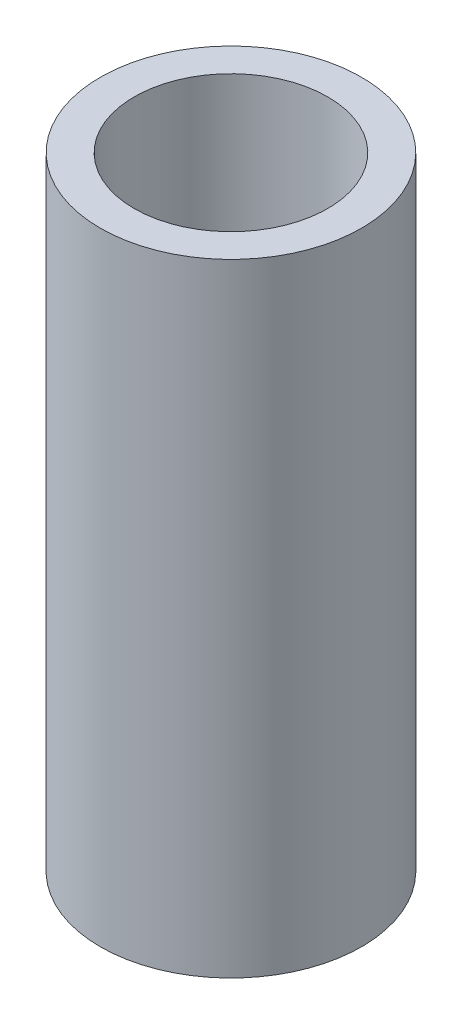
ISO-10303-21;
HEADER;
FILE_DESCRIPTION(('STEP AP214'),'2;1');
FILE_NAME('part.step','',(''),(''),'','','');
FILE_SCHEMA(('AUTOMOTIVE_DESIGN { 1 0 10303 214 1 1 1 1 }'));
ENDSEC;
DATA;
#1=APPLICATION_CONTEXT('core data for automotive mechanical design processes');
#2=APPLICATION_PROTOCOL_DEFINITION('international standard','automotive_design',2000,#1);
#3=PRODUCT_CONTEXT('',#1,'mechanical');
#4=PRODUCT('Part','Part','',(#3));
#5=PRODUCT_RELATED_PRODUCT_CATEGORY('part','',(#4));
#6=PRODUCT_DEFINITION_FORMATION('','',#4);
#7=PRODUCT_DEFINITION_CONTEXT('part definition',#1,'design');
#8=PRODUCT_DEFINITION('design','',#6,#7);
#9=PRODUCT_DEFINITION_SHAPE('','',#8);
#10=(LENGTH_UNIT() NAMED_UNIT(*) SI_UNIT(.MILLI.,.METRE.));
#11=(NAMED_UNIT(*) PLANE_ANGLE_UNIT() SI_UNIT($,.RADIAN.));
#12=(NAMED_UNIT(*) SI_UNIT($,.STERADIAN.) SOLID_ANGLE_UNIT());
#13=UNCERTAINTY_MEASURE_WITH_UNIT(LENGTH_MEASURE(1.E-05),#10,'distance_accuracy_value','');
#14=(GEOMETRIC_REPRESENTATION_CONTEXT(3) GLOBAL_UNCERTAINTY_ASSIGNED_CONTEXT((#13)) GLOBAL_UNIT_ASSIGNED_CONTEXT((#10,
#11,#12)) REPRESENTATION_CONTEXT('',''));
#15=CARTESIAN_POINT('',(0.,0.,0.));
#16=DIRECTION('',(0.,0.,1.));
#17=DIRECTION('',(1.,0.,0.));
#18=AXIS2_PLACEMENT_3D('',#15,#16,#17);
#19=CARTESIAN_POINT('',(0.,50.8,0.));
#20=DIRECTION('',(0.,1.,0.));
#21=DIRECTION('',(0.,0.,1.));
#22=AXIS2_PLACEMENT_3D('',#19,#20,#21);
#23=PLANE('',#22);
#24=CARTESIAN_POINT('',(0.,50.8,0.));
#25=DIRECTION('',(0.,1.,0.));
#26=DIRECTION('',(0.,0.,1.));
#27=AXIS2_PLACEMENT_3D('',#24,#25,#26);
#28=CIRCLE('',#27,10.668);
#29=CARTESIAN_POINT('',(0.,50.8,10.668));
#30=VERTEX_POINT('',#29);
#31=EDGE_CURVE('E10',#30,#30,#28,.T.);
#32=ORIENTED_EDGE('',*,*,#31,.T.);
#33=EDGE_LOOP('',(#32));
#34=FACE_BOUND('',#33,.T.);
#35=CARTESIAN_POINT('',(0.,50.8,0.));
#36=DIRECTION('',(0.,1.,0.));
#37=DIRECTION('',(0.,0.,1.));
#38=AXIS2_PLACEMENT_3D('',#35,#36,#37);
#39=CIRCLE('',#38,7.8994);
#40=CARTESIAN_POINT('',(0.,50.8,7.8994));
#41=VERTEX_POINT('',#40);
#42=EDGE_CURVE('E44',#41,#41,#39,.T.);
#43=ORIENTED_EDGE('',*,*,#42,.F.);
#44=EDGE_LOOP('',(#43));
#45=FACE_BOUND('',#44,.T.);
#46=ADVANCED_FACE('F33',(#34,#45),#23,.T.);
#47=CARTESIAN_POINT('',(0.,0.,0.));
#48=DIRECTION('',(0.,1.,0.));
#49=DIRECTION('',(0.,0.,1.));
#50=AXIS2_PLACEMENT_3D('',#47,#48,#49);
#51=PLANE('',#50);
#52=CARTESIAN_POINT('',(0.,0.,0.));
#53=DIRECTION('',(0.,1.,0.));
#54=DIRECTION('',(0.,0.,1.));
#55=AXIS2_PLACEMENT_3D('',#52,#53,#54);
#56=CIRCLE('',#55,10.668);
#57=CARTESIAN_POINT('',(0.,0.,10.668));
#58=VERTEX_POINT('',#57);
#59=EDGE_CURVE('E37',#58,#58,#56,.T.);
#60=ORIENTED_EDGE('',*,*,#59,.F.);
#61=EDGE_LOOP('',(#60));
#62=FACE_BOUND('',#61,.T.);
#63=CARTESIAN_POINT('',(0.,0.,0.));
#64=DIRECTION('',(0.,1.,0.));
#65=DIRECTION('',(0.,0.,1.));
#66=AXIS2_PLACEMENT_3D('',#63,#64,#65);
#67=CIRCLE('',#66,7.8994);
#68=CARTESIAN_POINT('',(0.,0.,7.8994));
#69=VERTEX_POINT('',#68);
#70=EDGE_CURVE('E46',#69,#69,#67,.T.);
#71=ORIENTED_EDGE('',*,*,#70,.T.);
#72=EDGE_LOOP('',(#71));
#73=FACE_BOUND('',#72,.T.);
#74=ADVANCED_FACE('F56',(#62,#73),#51,.F.);
#75=CARTESIAN_POINT('',(0.,50.8,0.));
#76=DIRECTION('',(0.,-1.,0.));
#77=DIRECTION('',(0.,0.,-1.));
#78=AXIS2_PLACEMENT_3D('',#75,#76,#77);
#79=CYLINDRICAL_SURFACE('',#78,10.668);
#80=ORIENTED_EDGE('',*,*,#31,.F.);
#81=EDGE_LOOP('',(#80));
#82=FACE_BOUND('',#81,.T.);
#83=ORIENTED_EDGE('',*,*,#59,.T.);
#84=EDGE_LOOP('',(#83));
#85=FACE_BOUND('',#84,.T.);
#86=ADVANCED_FACE('F35',(#82,#85),#79,.T.);
#87=CARTESIAN_POINT('',(0.,50.8,0.));
#88=DIRECTION('',(0.,-1.,0.));
#89=DIRECTION('',(0.,0.,-1.));
#90=AXIS2_PLACEMENT_3D('',#87,#88,#89);
#91=CYLINDRICAL_SURFACE('',#90,7.8994);
#92=ORIENTED_EDGE('',*,*,#42,.T.);
#93=EDGE_LOOP('',(#92));
#94=FACE_BOUND('',#93,.T.);
#95=ORIENTED_EDGE('',*,*,#70,.F.);
#96=EDGE_LOOP('',(#95));
#97=FACE_BOUND('',#96,.T.);
#98=ADVANCED_FACE('F52',(#94,#97),#91,.F.);
#99=CLOSED_SHELL('',(#46,#74,#86,#98));
#100=MANIFOLD_SOLID_BREP('B2',#99);
#101=ADVANCED_BREP_SHAPE_REPRESENTATION('',(#18,#100),#14);
#102=SHAPE_DEFINITION_REPRESENTATION(#9,#101);
ENDSEC;
END-ISO-10303-21;
